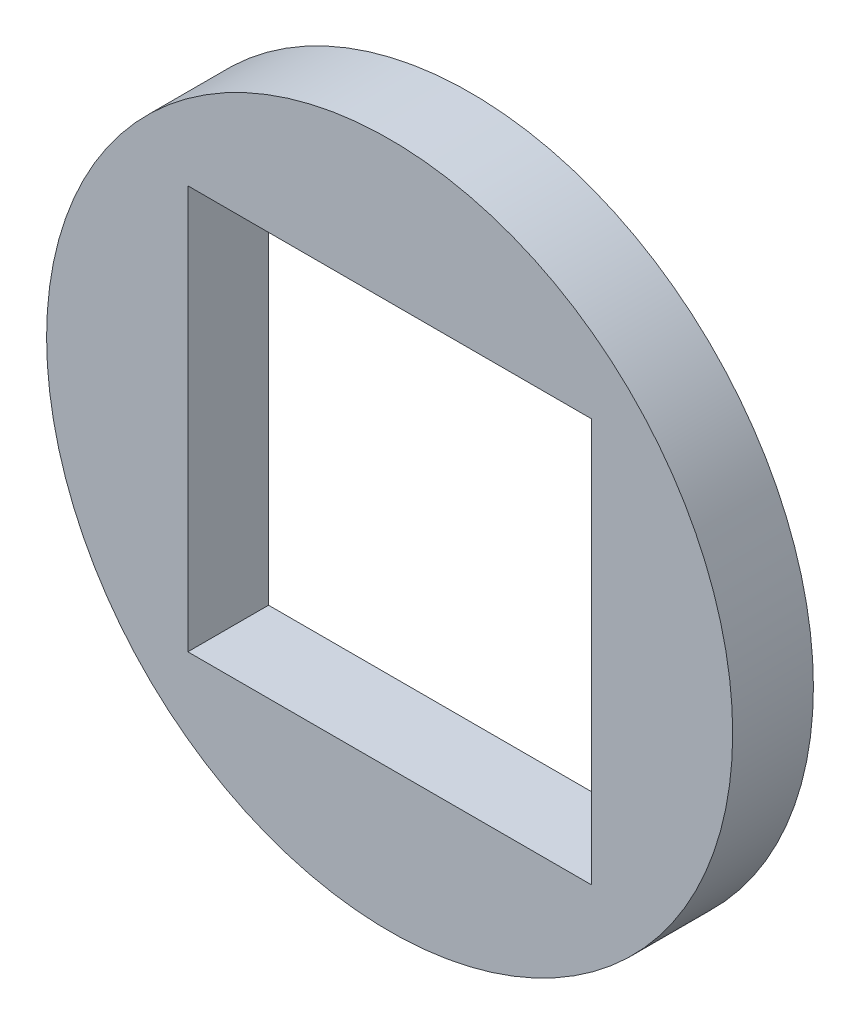
ISO-10303-21;
HEADER;
FILE_DESCRIPTION(('STEP AP214'),'2;1');
FILE_NAME('part.step','',(''),(''),'','','');
FILE_SCHEMA(('AUTOMOTIVE_DESIGN { 1 0 10303 214 1 1 1 1 }'));
ENDSEC;
DATA;
#1=APPLICATION_CONTEXT('core data for automotive mechanical design processes');
#2=APPLICATION_PROTOCOL_DEFINITION('international standard','automotive_design',2000,#1);
#3=PRODUCT_CONTEXT('',#1,'mechanical');
#4=PRODUCT('Part','Part','',(#3));
#5=PRODUCT_RELATED_PRODUCT_CATEGORY('part','',(#4));
#6=PRODUCT_DEFINITION_FORMATION('','',#4);
#7=PRODUCT_DEFINITION_CONTEXT('part definition',#1,'design');
#8=PRODUCT_DEFINITION('design','',#6,#7);
#9=PRODUCT_DEFINITION_SHAPE('','',#8);
#10=(LENGTH_UNIT() NAMED_UNIT(*) SI_UNIT(.MILLI.,.METRE.));
#11=(NAMED_UNIT(*) PLANE_ANGLE_UNIT() SI_UNIT($,.RADIAN.));
#12=(NAMED_UNIT(*) SI_UNIT($,.STERADIAN.) SOLID_ANGLE_UNIT());
#13=UNCERTAINTY_MEASURE_WITH_UNIT(LENGTH_MEASURE(1.E-05),#10,'distance_accuracy_value','');
#14=(GEOMETRIC_REPRESENTATION_CONTEXT(3) GLOBAL_UNCERTAINTY_ASSIGNED_CONTEXT((#13)) GLOBAL_UNIT_ASSIGNED_CONTEXT((#10,
#11,#12)) REPRESENTATION_CONTEXT('',''));
#15=CARTESIAN_POINT('',(0.,0.,0.));
#16=DIRECTION('',(0.,0.,1.));
#17=DIRECTION('',(1.,0.,0.));
#18=AXIS2_PLACEMENT_3D('',#15,#16,#17);
#19=CARTESIAN_POINT('',(0.,0.,2.));
#20=DIRECTION('',(0.,0.,1.));
#21=DIRECTION('',(1.,0.,0.));
#22=AXIS2_PLACEMENT_3D('',#19,#20,#21);
#23=PLANE('',#22);
#24=CARTESIAN_POINT('',(0.,0.,2.));
#25=DIRECTION('',(0.,0.,1.));
#26=DIRECTION('',(1.,0.,0.));
#27=AXIS2_PLACEMENT_3D('',#24,#25,#26);
#28=CIRCLE('',#27,8.5);
#29=CARTESIAN_POINT('',(8.5,0.,2.));
#30=VERTEX_POINT('',#29);
#31=EDGE_CURVE('E11',#30,#30,#28,.T.);
#32=ORIENTED_EDGE('',*,*,#31,.T.);
#33=EDGE_LOOP('',(#32));
#34=FACE_BOUND('',#33,.T.);
#35=DIRECTION('',(-1.,0.,0.));
#36=VECTOR('',#35,1.);
#37=CARTESIAN_POINT('',(-5.,5.,2.));
#38=LINE('',#37,#36);
#39=CARTESIAN_POINT('',(5.,5.,2.));
#40=VERTEX_POINT('',#39);
#41=CARTESIAN_POINT('',(-5.,5.,2.));
#42=VERTEX_POINT('',#41);
#43=EDGE_CURVE('E82',#40,#42,#38,.T.);
#44=ORIENTED_EDGE('',*,*,#43,.F.);
#45=DIRECTION('',(0.,1.,0.));
#46=VECTOR('',#45,1.);
#47=CARTESIAN_POINT('',(5.,-5.,2.));
#48=LINE('',#47,#46);
#49=CARTESIAN_POINT('',(5.,-5.,2.));
#50=VERTEX_POINT('',#49);
#51=EDGE_CURVE('E74',#50,#40,#48,.T.);
#52=ORIENTED_EDGE('',*,*,#51,.F.);
#53=DIRECTION('',(1.,0.,0.));
#54=VECTOR('',#53,1.);
#55=CARTESIAN_POINT('',(-5.,-5.,2.));
#56=LINE('',#55,#54);
#57=CARTESIAN_POINT('',(-5.,-5.,2.));
#58=VERTEX_POINT('',#57);
#59=EDGE_CURVE('E95',#58,#50,#56,.T.);
#60=ORIENTED_EDGE('',*,*,#59,.F.);
#61=DIRECTION('',(0.,-1.,0.));
#62=VECTOR('',#61,1.);
#63=CARTESIAN_POINT('',(-5.,-5.,2.));
#64=LINE('',#63,#62);
#65=EDGE_CURVE('E93',#42,#58,#64,.T.);
#66=ORIENTED_EDGE('',*,*,#65,.F.);
#67=EDGE_LOOP('',(#44,#52,#60,#66));
#68=FACE_BOUND('',#67,.T.);
#69=ADVANCED_FACE('F33',(#34,#68),#23,.T.);
#70=CARTESIAN_POINT('',(0.,0.,0.));
#71=DIRECTION('',(0.,0.,1.));
#72=DIRECTION('',(1.,0.,0.));
#73=AXIS2_PLACEMENT_3D('',#70,#71,#72);
#74=PLANE('',#73);
#75=CARTESIAN_POINT('',(0.,0.,0.));
#76=DIRECTION('',(0.,0.,1.));
#77=DIRECTION('',(1.,0.,0.));
#78=AXIS2_PLACEMENT_3D('',#75,#76,#77);
#79=CIRCLE('',#78,8.5);
#80=CARTESIAN_POINT('',(8.5,0.,0.));
#81=VERTEX_POINT('',#80);
#82=EDGE_CURVE('E37',#81,#81,#79,.T.);
#83=ORIENTED_EDGE('',*,*,#82,.F.);
#84=EDGE_LOOP('',(#83));
#85=FACE_BOUND('',#84,.T.);
#86=DIRECTION('',(0.,1.,0.));
#87=VECTOR('',#86,1.);
#88=CARTESIAN_POINT('',(5.,-5.,0.));
#89=LINE('',#88,#87);
#90=CARTESIAN_POINT('',(5.,-5.,0.));
#91=VERTEX_POINT('',#90);
#92=CARTESIAN_POINT('',(5.,5.,0.));
#93=VERTEX_POINT('',#92);
#94=EDGE_CURVE('E56',#91,#93,#89,.T.);
#95=ORIENTED_EDGE('',*,*,#94,.T.);
#96=DIRECTION('',(-1.,0.,0.));
#97=VECTOR('',#96,1.);
#98=CARTESIAN_POINT('',(-5.,5.,0.));
#99=LINE('',#98,#97);
#100=CARTESIAN_POINT('',(-5.,5.,0.));
#101=VERTEX_POINT('',#100);
#102=EDGE_CURVE('E89',#93,#101,#99,.T.);
#103=ORIENTED_EDGE('',*,*,#102,.T.);
#104=DIRECTION('',(0.,-1.,0.));
#105=VECTOR('',#104,1.);
#106=CARTESIAN_POINT('',(-5.,-5.,0.));
#107=LINE('',#106,#105);
#108=CARTESIAN_POINT('',(-5.,-5.,0.));
#109=VERTEX_POINT('',#108);
#110=EDGE_CURVE('E101',#101,#109,#107,.T.);
#111=ORIENTED_EDGE('',*,*,#110,.T.);
#112=DIRECTION('',(1.,0.,0.));
#113=VECTOR('',#112,1.);
#114=CARTESIAN_POINT('',(-5.,-5.,0.));
#115=LINE('',#114,#113);
#116=EDGE_CURVE('E83',#109,#91,#115,.T.);
#117=ORIENTED_EDGE('',*,*,#116,.T.);
#118=EDGE_LOOP('',(#95,#103,#111,#117));
#119=FACE_BOUND('',#118,.T.);
#120=ADVANCED_FACE('F112',(#85,#119),#74,.F.);
#121=CARTESIAN_POINT('',(0.,0.,2.));
#122=DIRECTION('',(0.,0.,-1.));
#123=DIRECTION('',(-1.,0.,0.));
#124=AXIS2_PLACEMENT_3D('',#121,#122,#123);
#125=CYLINDRICAL_SURFACE('',#124,8.5);
#126=ORIENTED_EDGE('',*,*,#31,.F.);
#127=EDGE_LOOP('',(#126));
#128=FACE_BOUND('',#127,.T.);
#129=ORIENTED_EDGE('',*,*,#82,.T.);
#130=EDGE_LOOP('',(#129));
#131=FACE_BOUND('',#130,.T.);
#132=ADVANCED_FACE('F35',(#128,#131),#125,.T.);
#133=CARTESIAN_POINT('',(5.,-5.,2.));
#134=DIRECTION('',(-1.,0.,0.));
#135=DIRECTION('',(0.,0.,1.));
#136=AXIS2_PLACEMENT_3D('',#133,#134,#135);
#137=PLANE('',#136);
#138=ORIENTED_EDGE('',*,*,#94,.F.);
#139=DIRECTION('',(0.,0.,-1.));
#140=VECTOR('',#139,1.);
#141=CARTESIAN_POINT('',(5.,-5.,2.));
#142=LINE('',#141,#140);
#143=EDGE_CURVE('E78',#50,#91,#142,.T.);
#144=ORIENTED_EDGE('',*,*,#143,.F.);
#145=ORIENTED_EDGE('',*,*,#51,.T.);
#146=DIRECTION('',(0.,0.,-1.));
#147=VECTOR('',#146,1.);
#148=CARTESIAN_POINT('',(5.,5.,2.));
#149=LINE('',#148,#147);
#150=EDGE_CURVE('E77',#40,#93,#149,.T.);
#151=ORIENTED_EDGE('',*,*,#150,.T.);
#152=EDGE_LOOP('',(#138,#144,#145,#151));
#153=FACE_BOUND('',#152,.T.);
#154=ADVANCED_FACE('F76',(#153),#137,.T.);
#155=CARTESIAN_POINT('',(-5.,5.,2.));
#156=DIRECTION('',(0.,-1.,0.));
#157=DIRECTION('',(0.,0.,-1.));
#158=AXIS2_PLACEMENT_3D('',#155,#156,#157);
#159=PLANE('',#158);
#160=ORIENTED_EDGE('',*,*,#102,.F.);
#161=ORIENTED_EDGE('',*,*,#150,.F.);
#162=ORIENTED_EDGE('',*,*,#43,.T.);
#163=DIRECTION('',(0.,0.,-1.));
#164=VECTOR('',#163,1.);
#165=CARTESIAN_POINT('',(-5.,5.,2.));
#166=LINE('',#165,#164);
#167=EDGE_CURVE('E90',#42,#101,#166,.T.);
#168=ORIENTED_EDGE('',*,*,#167,.T.);
#169=EDGE_LOOP('',(#160,#161,#162,#168));
#170=FACE_BOUND('',#169,.T.);
#171=ADVANCED_FACE('F86',(#170),#159,.T.);
#172=CARTESIAN_POINT('',(-5.,-5.,2.));
#173=DIRECTION('',(1.,0.,0.));
#174=DIRECTION('',(0.,0.,-1.));
#175=AXIS2_PLACEMENT_3D('',#172,#173,#174);
#176=PLANE('',#175);
#177=ORIENTED_EDGE('',*,*,#110,.F.);
#178=ORIENTED_EDGE('',*,*,#167,.F.);
#179=ORIENTED_EDGE('',*,*,#65,.T.);
#180=DIRECTION('',(0.,0.,-1.));
#181=VECTOR('',#180,1.);
#182=CARTESIAN_POINT('',(-5.,-5.,2.));
#183=LINE('',#182,#181);
#184=EDGE_CURVE('E48',#58,#109,#183,.T.);
#185=ORIENTED_EDGE('',*,*,#184,.T.);
#186=EDGE_LOOP('',(#177,#178,#179,#185));
#187=FACE_BOUND('',#186,.T.);
#188=ADVANCED_FACE('F110',(#187),#176,.T.);
#189=CARTESIAN_POINT('',(-5.,-5.,2.));
#190=DIRECTION('',(0.,1.,0.));
#191=DIRECTION('',(0.,0.,1.));
#192=AXIS2_PLACEMENT_3D('',#189,#190,#191);
#193=PLANE('',#192);
#194=ORIENTED_EDGE('',*,*,#116,.F.);
#195=ORIENTED_EDGE('',*,*,#184,.F.);
#196=ORIENTED_EDGE('',*,*,#59,.T.);
#197=ORIENTED_EDGE('',*,*,#143,.T.);
#198=EDGE_LOOP('',(#194,#195,#196,#197));
#199=FACE_BOUND('',#198,.T.);
#200=ADVANCED_FACE('F113',(#199),#193,.T.);
#201=CLOSED_SHELL('',(#69,#120,#132,#154,#171,#188,#200));
#202=MANIFOLD_SOLID_BREP('B2',#201);
#203=ADVANCED_BREP_SHAPE_REPRESENTATION('',(#18,#202),#14);
#204=SHAPE_DEFINITION_REPRESENTATION(#9,#203);
ENDSEC;
END-ISO-10303-21;
